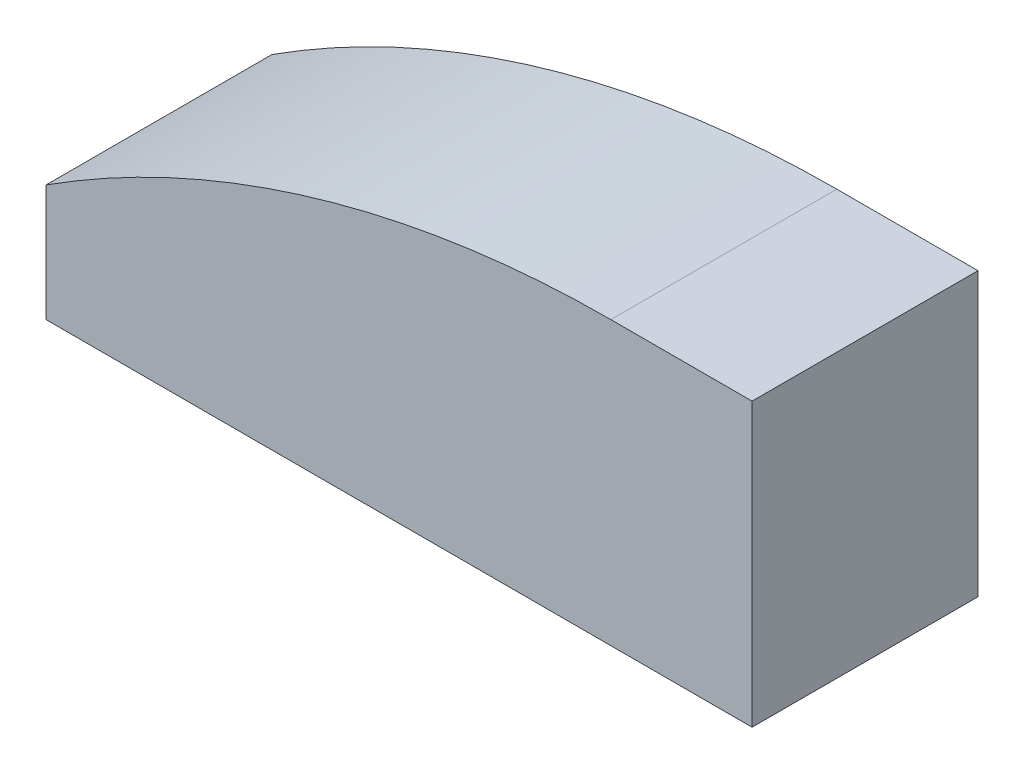
ISO-10303-21;
HEADER;
FILE_DESCRIPTION(('STEP AP214'),'2;1');
FILE_NAME('part.step','',(''),(''),'','','');
FILE_SCHEMA(('AUTOMOTIVE_DESIGN { 1 0 10303 214 1 1 1 1 }'));
ENDSEC;
DATA;
#1=APPLICATION_CONTEXT('core data for automotive mechanical design processes');
#2=APPLICATION_PROTOCOL_DEFINITION('international standard','automotive_design',2000,#1);
#3=PRODUCT_CONTEXT('',#1,'mechanical');
#4=PRODUCT('Part','Part','',(#3));
#5=PRODUCT_RELATED_PRODUCT_CATEGORY('part','',(#4));
#6=PRODUCT_DEFINITION_FORMATION('','',#4);
#7=PRODUCT_DEFINITION_CONTEXT('part definition',#1,'design');
#8=PRODUCT_DEFINITION('design','',#6,#7);
#9=PRODUCT_DEFINITION_SHAPE('','',#8);
#10=(LENGTH_UNIT() NAMED_UNIT(*) SI_UNIT(.MILLI.,.METRE.));
#11=(NAMED_UNIT(*) PLANE_ANGLE_UNIT() SI_UNIT($,.RADIAN.));
#12=(NAMED_UNIT(*) SI_UNIT($,.STERADIAN.) SOLID_ANGLE_UNIT());
#13=UNCERTAINTY_MEASURE_WITH_UNIT(LENGTH_MEASURE(1.E-05),#10,'distance_accuracy_value','');
#14=(GEOMETRIC_REPRESENTATION_CONTEXT(3) GLOBAL_UNCERTAINTY_ASSIGNED_CONTEXT((#13)) GLOBAL_UNIT_ASSIGNED_CONTEXT((#10,
#11,#12)) REPRESENTATION_CONTEXT('',''));
#15=CARTESIAN_POINT('',(0.,0.,0.));
#16=DIRECTION('',(0.,0.,1.));
#17=DIRECTION('',(1.,0.,0.));
#18=AXIS2_PLACEMENT_3D('',#15,#16,#17);
#19=CARTESIAN_POINT('',(-25.,-185.,20.));
#20=DIRECTION('',(0.,0.,-1.));
#21=DIRECTION('',(-1.,0.,0.));
#22=AXIS2_PLACEMENT_3D('',#19,#20,#21);
#23=CYLINDRICAL_SURFACE('',#22,185.);
#24=CARTESIAN_POINT('',(-25.,-185.,-20.));
#25=DIRECTION('',(0.,0.,1.));
#26=DIRECTION('',(-1.,0.,0.));
#27=AXIS2_PLACEMENT_3D('',#24,#25,#26);
#28=CIRCLE('',#27,185.);
#29=CARTESIAN_POINT('',(-25.,0.,-20.));
#30=VERTEX_POINT('',#29);
#31=CARTESIAN_POINT('',(-125.,-29.3561758372662,-20.));
#32=VERTEX_POINT('',#31);
#33=EDGE_CURVE('E108',#30,#32,#28,.T.);
#34=ORIENTED_EDGE('',*,*,#33,.T.);
#35=DIRECTION('',(0.,0.,-1.));
#36=VECTOR('',#35,1.);
#37=CARTESIAN_POINT('',(-125.,-29.3561758372662,20.));
#38=LINE('',#37,#36);
#39=CARTESIAN_POINT('',(-125.,-29.3561758372662,20.));
#40=VERTEX_POINT('',#39);
#41=EDGE_CURVE('E11',#40,#32,#38,.T.);
#42=ORIENTED_EDGE('',*,*,#41,.F.);
#43=CARTESIAN_POINT('',(-25.,-185.,20.));
#44=DIRECTION('',(0.,0.,1.));
#45=DIRECTION('',(-1.,0.,0.));
#46=AXIS2_PLACEMENT_3D('',#43,#44,#45);
#47=CIRCLE('',#46,185.);
#48=CARTESIAN_POINT('',(-25.,0.,20.));
#49=VERTEX_POINT('',#48);
#50=EDGE_CURVE('E116',#49,#40,#47,.T.);
#51=ORIENTED_EDGE('',*,*,#50,.F.);
#52=DIRECTION('',(0.,0.,-1.));
#53=VECTOR('',#52,1.);
#54=CARTESIAN_POINT('',(-25.,0.,20.));
#55=LINE('',#54,#53);
#56=EDGE_CURVE('E104',#49,#30,#55,.T.);
#57=ORIENTED_EDGE('',*,*,#56,.T.);
#58=EDGE_LOOP('',(#34,#42,#51,#57));
#59=FACE_BOUND('',#58,.T.);
#60=ADVANCED_FACE('F34',(#59),#23,.T.);
#61=CARTESIAN_POINT('',(-125.,-50.,20.));
#62=DIRECTION('',(1.,0.,0.));
#63=DIRECTION('',(0.,0.,-1.));
#64=AXIS2_PLACEMENT_3D('',#61,#62,#63);
#65=PLANE('',#64);
#66=DIRECTION('',(0.,-1.,0.));
#67=VECTOR('',#66,1.);
#68=CARTESIAN_POINT('',(-125.,-50.,-20.));
#69=LINE('',#68,#67);
#70=CARTESIAN_POINT('',(-125.,-50.,-20.));
#71=VERTEX_POINT('',#70);
#72=EDGE_CURVE('E111',#32,#71,#69,.T.);
#73=ORIENTED_EDGE('',*,*,#72,.T.);
#74=DIRECTION('',(0.,0.,-1.));
#75=VECTOR('',#74,1.);
#76=CARTESIAN_POINT('',(-125.,-50.,20.));
#77=LINE('',#76,#75);
#78=CARTESIAN_POINT('',(-125.,-50.,20.));
#79=VERTEX_POINT('',#78);
#80=EDGE_CURVE('E42',#79,#71,#77,.T.);
#81=ORIENTED_EDGE('',*,*,#80,.F.);
#82=DIRECTION('',(0.,-1.,0.));
#83=VECTOR('',#82,1.);
#84=CARTESIAN_POINT('',(-125.,-50.,20.));
#85=LINE('',#84,#83);
#86=EDGE_CURVE('E84',#40,#79,#85,.T.);
#87=ORIENTED_EDGE('',*,*,#86,.F.);
#88=ORIENTED_EDGE('',*,*,#41,.T.);
#89=EDGE_LOOP('',(#73,#81,#87,#88));
#90=FACE_BOUND('',#89,.T.);
#91=ADVANCED_FACE('F135',(#90),#65,.F.);
#92=CARTESIAN_POINT('',(0.,-50.,20.));
#93=DIRECTION('',(0.,1.,0.));
#94=DIRECTION('',(-1.,0.,0.));
#95=AXIS2_PLACEMENT_3D('',#92,#93,#94);
#96=PLANE('',#95);
#97=DIRECTION('',(1.,0.,0.));
#98=VECTOR('',#97,1.);
#99=CARTESIAN_POINT('',(0.,-50.,-20.));
#100=LINE('',#99,#98);
#101=CARTESIAN_POINT('',(0.,-50.,-20.));
#102=VERTEX_POINT('',#101);
#103=EDGE_CURVE('E99',#71,#102,#100,.T.);
#104=ORIENTED_EDGE('',*,*,#103,.T.);
#105=DIRECTION('',(0.,0.,-1.));
#106=VECTOR('',#105,1.);
#107=CARTESIAN_POINT('',(0.,-50.,20.));
#108=LINE('',#107,#106);
#109=CARTESIAN_POINT('',(0.,-50.,20.));
#110=VERTEX_POINT('',#109);
#111=EDGE_CURVE('E96',#110,#102,#108,.T.);
#112=ORIENTED_EDGE('',*,*,#111,.F.);
#113=DIRECTION('',(1.,0.,0.));
#114=VECTOR('',#113,1.);
#115=CARTESIAN_POINT('',(0.,-50.,20.));
#116=LINE('',#115,#114);
#117=EDGE_CURVE('E88',#79,#110,#116,.T.);
#118=ORIENTED_EDGE('',*,*,#117,.F.);
#119=ORIENTED_EDGE('',*,*,#80,.T.);
#120=EDGE_LOOP('',(#104,#112,#118,#119));
#121=FACE_BOUND('',#120,.T.);
#122=ADVANCED_FACE('F97',(#121),#96,.F.);
#123=CARTESIAN_POINT('',(0.,0.,20.));
#124=DIRECTION('',(-1.,0.,0.));
#125=DIRECTION('',(0.,-1.,0.));
#126=AXIS2_PLACEMENT_3D('',#123,#124,#125);
#127=PLANE('',#126);
#128=DIRECTION('',(0.,1.,0.));
#129=VECTOR('',#128,1.);
#130=CARTESIAN_POINT('',(0.,0.,-20.));
#131=LINE('',#130,#129);
#132=CARTESIAN_POINT('',(0.,0.,-20.));
#133=VERTEX_POINT('',#132);
#134=EDGE_CURVE('E70',#102,#133,#131,.T.);
#135=ORIENTED_EDGE('',*,*,#134,.T.);
#136=DIRECTION('',(0.,0.,-1.));
#137=VECTOR('',#136,1.);
#138=CARTESIAN_POINT('',(0.,0.,20.));
#139=LINE('',#138,#137);
#140=CARTESIAN_POINT('',(0.,0.,20.));
#141=VERTEX_POINT('',#140);
#142=EDGE_CURVE('E100',#141,#133,#139,.T.);
#143=ORIENTED_EDGE('',*,*,#142,.F.);
#144=DIRECTION('',(0.,1.,0.));
#145=VECTOR('',#144,1.);
#146=CARTESIAN_POINT('',(0.,0.,20.));
#147=LINE('',#146,#145);
#148=EDGE_CURVE('E92',#110,#141,#147,.T.);
#149=ORIENTED_EDGE('',*,*,#148,.F.);
#150=ORIENTED_EDGE('',*,*,#111,.T.);
#151=EDGE_LOOP('',(#135,#143,#149,#150));
#152=FACE_BOUND('',#151,.T.);
#153=ADVANCED_FACE('F102',(#152),#127,.F.);
#154=CARTESIAN_POINT('',(-25.,0.,20.));
#155=DIRECTION('',(0.,-1.,0.));
#156=DIRECTION('',(0.,0.,-1.));
#157=AXIS2_PLACEMENT_3D('',#154,#155,#156);
#158=PLANE('',#157);
#159=DIRECTION('',(-1.,0.,0.));
#160=VECTOR('',#159,1.);
#161=CARTESIAN_POINT('',(-25.,0.,-20.));
#162=LINE('',#161,#160);
#163=EDGE_CURVE('E76',#133,#30,#162,.T.);
#164=ORIENTED_EDGE('',*,*,#163,.T.);
#165=ORIENTED_EDGE('',*,*,#56,.F.);
#166=DIRECTION('',(-1.,0.,0.));
#167=VECTOR('',#166,1.);
#168=CARTESIAN_POINT('',(-25.,0.,20.));
#169=LINE('',#168,#167);
#170=EDGE_CURVE('E50',#141,#49,#169,.T.);
#171=ORIENTED_EDGE('',*,*,#170,.F.);
#172=ORIENTED_EDGE('',*,*,#142,.T.);
#173=EDGE_LOOP('',(#164,#165,#171,#172));
#174=FACE_BOUND('',#173,.T.);
#175=ADVANCED_FACE('F124',(#174),#158,.F.);
#176=CARTESIAN_POINT('',(-25.,-185.,20.));
#177=DIRECTION('',(0.,0.,-1.));
#178=DIRECTION('',(-1.,0.,0.));
#179=AXIS2_PLACEMENT_3D('',#176,#177,#178);
#180=PLANE('',#179);
#181=ORIENTED_EDGE('',*,*,#50,.T.);
#182=ORIENTED_EDGE('',*,*,#86,.T.);
#183=ORIENTED_EDGE('',*,*,#117,.T.);
#184=ORIENTED_EDGE('',*,*,#148,.T.);
#185=ORIENTED_EDGE('',*,*,#170,.T.);
#186=EDGE_LOOP('',(#181,#182,#183,#184,#185));
#187=FACE_BOUND('',#186,.T.);
#188=ADVANCED_FACE('F90',(#187),#180,.F.);
#189=CARTESIAN_POINT('',(-25.,-185.,-20.));
#190=DIRECTION('',(0.,0.,-1.));
#191=DIRECTION('',(-1.,0.,0.));
#192=AXIS2_PLACEMENT_3D('',#189,#190,#191);
#193=PLANE('',#192);
#194=ORIENTED_EDGE('',*,*,#33,.F.);
#195=ORIENTED_EDGE('',*,*,#163,.F.);
#196=ORIENTED_EDGE('',*,*,#134,.F.);
#197=ORIENTED_EDGE('',*,*,#103,.F.);
#198=ORIENTED_EDGE('',*,*,#72,.F.);
#199=EDGE_LOOP('',(#194,#195,#196,#197,#198));
#200=FACE_BOUND('',#199,.T.);
#201=ADVANCED_FACE('F120',(#200),#193,.T.);
#202=CLOSED_SHELL('',(#60,#91,#122,#153,#175,#188,#201));
#203=MANIFOLD_SOLID_BREP('B2',#202);
#204=ADVANCED_BREP_SHAPE_REPRESENTATION('',(#18,#203),#14);
#205=SHAPE_DEFINITION_REPRESENTATION(#9,#204);
ENDSEC;
END-ISO-10303-21;
